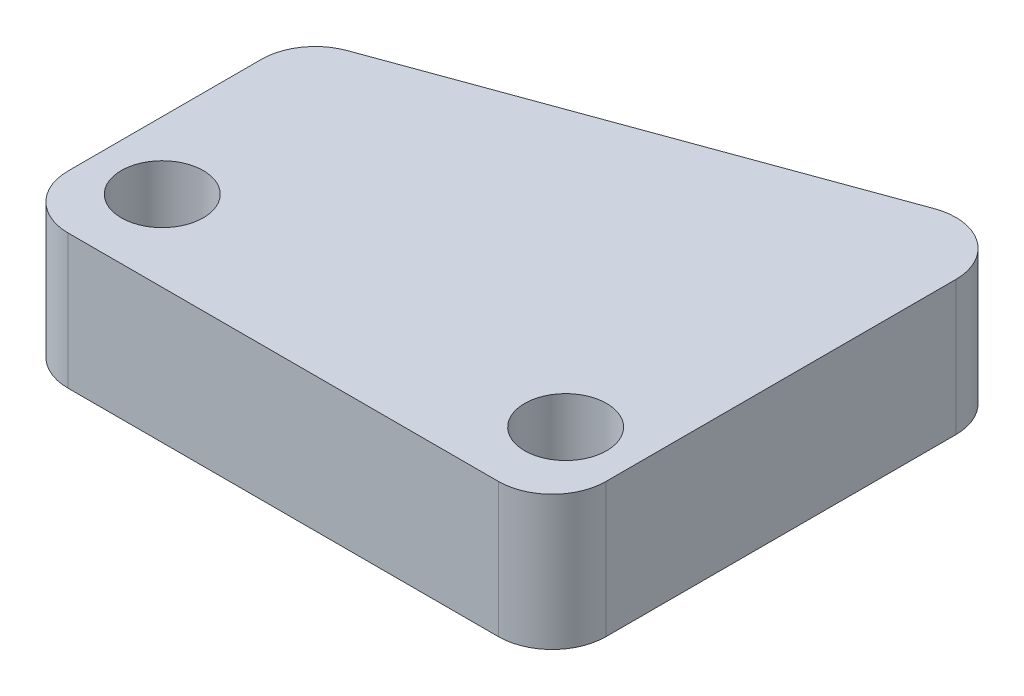
ISO-10303-21;
HEADER;
FILE_DESCRIPTION(('STEP AP214'),'2;1');
FILE_NAME('part.step','',(''),(''),'','','');
FILE_SCHEMA(('AUTOMOTIVE_DESIGN { 1 0 10303 214 1 1 1 1 }'));
ENDSEC;
DATA;
#1=APPLICATION_CONTEXT('core data for automotive mechanical design processes');
#2=APPLICATION_PROTOCOL_DEFINITION('international standard','automotive_design',2000,#1);
#3=PRODUCT_CONTEXT('',#1,'mechanical');
#4=PRODUCT('Part','Part','',(#3));
#5=PRODUCT_RELATED_PRODUCT_CATEGORY('part','',(#4));
#6=PRODUCT_DEFINITION_FORMATION('','',#4);
#7=PRODUCT_DEFINITION_CONTEXT('part definition',#1,'design');
#8=PRODUCT_DEFINITION('design','',#6,#7);
#9=PRODUCT_DEFINITION_SHAPE('','',#8);
#10=(LENGTH_UNIT() NAMED_UNIT(*) SI_UNIT(.MILLI.,.METRE.));
#11=(NAMED_UNIT(*) PLANE_ANGLE_UNIT() SI_UNIT($,.RADIAN.));
#12=(NAMED_UNIT(*) SI_UNIT($,.STERADIAN.) SOLID_ANGLE_UNIT());
#13=UNCERTAINTY_MEASURE_WITH_UNIT(LENGTH_MEASURE(1.E-05),#10,'distance_accuracy_value','');
#14=(GEOMETRIC_REPRESENTATION_CONTEXT(3) GLOBAL_UNCERTAINTY_ASSIGNED_CONTEXT((#13)) GLOBAL_UNIT_ASSIGNED_CONTEXT((#10,
#11,#12)) REPRESENTATION_CONTEXT('',''));
#15=CARTESIAN_POINT('',(0.,0.,0.));
#16=DIRECTION('',(0.,0.,1.));
#17=DIRECTION('',(1.,0.,0.));
#18=AXIS2_PLACEMENT_3D('',#15,#16,#17);
#19=CARTESIAN_POINT('',(10.,5.,10.));
#20=DIRECTION('',(-1.,0.,0.));
#21=DIRECTION('',(0.,0.,1.));
#22=AXIS2_PLACEMENT_3D('',#19,#20,#21);
#23=PLANE('',#22);
#24=DIRECTION('',(0.,0.,-1.));
#25=VECTOR('',#24,1.);
#26=CARTESIAN_POINT('',(10.,5.,10.));
#27=LINE('',#26,#25);
#28=CARTESIAN_POINT('',(10.,5.,8.));
#29=VERTEX_POINT('',#28);
#30=CARTESIAN_POINT('',(10.,5.,-5.00891989410654));
#31=VERTEX_POINT('',#30);
#32=EDGE_CURVE('E129',#29,#31,#27,.T.);
#33=ORIENTED_EDGE('',*,*,#32,.F.);
#34=DIRECTION('',(0.,-1.,0.));
#35=VECTOR('',#34,1.);
#36=CARTESIAN_POINT('',(10.,5.,8.));
#37=LINE('',#36,#35);
#38=CARTESIAN_POINT('',(10.,0.,8.));
#39=VERTEX_POINT('',#38);
#40=EDGE_CURVE('E161',#29,#39,#37,.T.);
#41=ORIENTED_EDGE('',*,*,#40,.T.);
#42=DIRECTION('',(0.,0.,-1.));
#43=VECTOR('',#42,1.);
#44=CARTESIAN_POINT('',(10.,0.,10.));
#45=LINE('',#44,#43);
#46=CARTESIAN_POINT('',(10.,0.,-5.00891989410654));
#47=VERTEX_POINT('',#46);
#48=EDGE_CURVE('E134',#39,#47,#45,.T.);
#49=ORIENTED_EDGE('',*,*,#48,.T.);
#50=DIRECTION('',(0.,1.,0.));
#51=VECTOR('',#50,1.);
#52=CARTESIAN_POINT('',(10.,5.,-5.00891989410654));
#53=LINE('',#52,#51);
#54=EDGE_CURVE('E158',#47,#31,#53,.T.);
#55=ORIENTED_EDGE('',*,*,#54,.T.);
#56=EDGE_LOOP('',(#33,#41,#49,#55));
#57=FACE_BOUND('',#56,.T.);
#58=ADVANCED_FACE('F36',(#57),#23,.F.);
#59=CARTESIAN_POINT('',(-10.,5.,10.));
#60=DIRECTION('',(1.,0.,0.));
#61=DIRECTION('',(0.,0.,-1.));
#62=AXIS2_PLACEMENT_3D('',#59,#60,#61);
#63=PLANE('',#62);
#64=DIRECTION('',(0.,0.,1.));
#65=VECTOR('',#64,1.);
#66=CARTESIAN_POINT('',(-10.,0.,10.));
#67=LINE('',#66,#65);
#68=CARTESIAN_POINT('',(-10.,0.,0.814603854152647));
#69=VERTEX_POINT('',#68);
#70=CARTESIAN_POINT('',(-10.,0.,8.));
#71=VERTEX_POINT('',#70);
#72=EDGE_CURVE('E130',#69,#71,#67,.T.);
#73=ORIENTED_EDGE('',*,*,#72,.T.);
#74=DIRECTION('',(0.,-1.,0.));
#75=VECTOR('',#74,1.);
#76=CARTESIAN_POINT('',(-10.,5.,8.));
#77=LINE('',#76,#75);
#78=CARTESIAN_POINT('',(-10.,5.,8.));
#79=VERTEX_POINT('',#78);
#80=EDGE_CURVE('E107',#71,#79,#77,.F.);
#81=ORIENTED_EDGE('',*,*,#80,.T.);
#82=DIRECTION('',(0.,0.,1.));
#83=VECTOR('',#82,1.);
#84=CARTESIAN_POINT('',(-10.,5.,10.));
#85=LINE('',#84,#83);
#86=CARTESIAN_POINT('',(-10.,5.,0.814603854152647));
#87=VERTEX_POINT('',#86);
#88=EDGE_CURVE('E132',#87,#79,#85,.T.);
#89=ORIENTED_EDGE('',*,*,#88,.F.);
#90=DIRECTION('',(0.,1.,0.));
#91=VECTOR('',#90,1.);
#92=CARTESIAN_POINT('',(-10.,5.,0.814603854152647));
#93=LINE('',#92,#91);
#94=EDGE_CURVE('E112',#87,#69,#93,.F.);
#95=ORIENTED_EDGE('',*,*,#94,.T.);
#96=EDGE_LOOP('',(#73,#81,#89,#95));
#97=FACE_BOUND('',#96,.T.);
#98=ADVANCED_FACE('F213',(#97),#63,.F.);
#99=CARTESIAN_POINT('',(-10.,5.,10.));
#100=DIRECTION('',(0.,0.,-1.));
#101=DIRECTION('',(-1.,0.,0.));
#102=AXIS2_PLACEMENT_3D('',#99,#100,#101);
#103=PLANE('',#102);
#104=DIRECTION('',(1.,0.,0.));
#105=VECTOR('',#104,1.);
#106=CARTESIAN_POINT('',(-10.,5.,10.));
#107=LINE('',#106,#105);
#108=CARTESIAN_POINT('',(-8.,5.,10.));
#109=VERTEX_POINT('',#108);
#110=CARTESIAN_POINT('',(8.,5.,10.));
#111=VERTEX_POINT('',#110);
#112=EDGE_CURVE('E122',#109,#111,#107,.T.);
#113=ORIENTED_EDGE('',*,*,#112,.F.);
#114=DIRECTION('',(0.,-1.,0.));
#115=VECTOR('',#114,1.);
#116=CARTESIAN_POINT('',(-8.,5.,10.));
#117=LINE('',#116,#115);
#118=CARTESIAN_POINT('',(-8.,0.,10.));
#119=VERTEX_POINT('',#118);
#120=EDGE_CURVE('E106',#109,#119,#117,.T.);
#121=ORIENTED_EDGE('',*,*,#120,.T.);
#122=DIRECTION('',(1.,0.,0.));
#123=VECTOR('',#122,1.);
#124=CARTESIAN_POINT('',(-10.,0.,10.));
#125=LINE('',#124,#123);
#126=CARTESIAN_POINT('',(8.,0.,10.));
#127=VERTEX_POINT('',#126);
#128=EDGE_CURVE('E119',#119,#127,#125,.T.);
#129=ORIENTED_EDGE('',*,*,#128,.T.);
#130=DIRECTION('',(0.,-1.,0.));
#131=VECTOR('',#130,1.);
#132=CARTESIAN_POINT('',(8.,5.,10.));
#133=LINE('',#132,#131);
#134=EDGE_CURVE('E124',#127,#111,#133,.F.);
#135=ORIENTED_EDGE('',*,*,#134,.T.);
#136=EDGE_LOOP('',(#113,#121,#129,#135));
#137=FACE_BOUND('',#136,.T.);
#138=ADVANCED_FACE('F118',(#137),#103,.F.);
#139=CARTESIAN_POINT('',(0.,5.,0.));
#140=DIRECTION('',(0.,-1.,0.));
#141=DIRECTION('',(0.,0.,-1.));
#142=AXIS2_PLACEMENT_3D('',#139,#140,#141);
#143=PLANE('',#142);
#144=CARTESIAN_POINT('',(-7.5,5.,7.));
#145=DIRECTION('',(0.,1.,0.));
#146=DIRECTION('',(0.,0.,1.));
#147=AXIS2_PLACEMENT_3D('',#144,#145,#146);
#148=CIRCLE('',#147,1.525);
#149=CARTESIAN_POINT('',(-7.5,5.,8.525));
#150=VERTEX_POINT('',#149);
#151=EDGE_CURVE('E142',#150,#150,#148,.T.);
#152=ORIENTED_EDGE('',*,*,#151,.F.);
#153=EDGE_LOOP('',(#152));
#154=FACE_BOUND('',#153,.T.);
#155=CARTESIAN_POINT('',(7.5,5.,7.));
#156=DIRECTION('',(0.,1.,0.));
#157=DIRECTION('',(0.,0.,1.));
#158=AXIS2_PLACEMENT_3D('',#155,#156,#157);
#159=CIRCLE('',#158,1.525);
#160=CARTESIAN_POINT('',(7.5,5.,8.525));
#161=VERTEX_POINT('',#160);
#162=EDGE_CURVE('E174',#161,#161,#159,.T.);
#163=ORIENTED_EDGE('',*,*,#162,.F.);
#164=EDGE_LOOP('',(#163));
#165=FACE_BOUND('',#164,.T.);
#166=ORIENTED_EDGE('',*,*,#88,.T.);
#167=CARTESIAN_POINT('',(-8.,5.,8.));
#168=DIRECTION('',(0.,-1.,0.));
#169=DIRECTION('',(0.,0.,-1.));
#170=AXIS2_PLACEMENT_3D('',#167,#168,#169);
#171=CIRCLE('',#170,2.);
#172=EDGE_CURVE('E156',#79,#109,#171,.F.);
#173=ORIENTED_EDGE('',*,*,#172,.T.);
#174=ORIENTED_EDGE('',*,*,#112,.T.);
#175=CARTESIAN_POINT('',(8.,5.,8.));
#176=DIRECTION('',(0.,-1.,0.));
#177=DIRECTION('',(0.,0.,-1.));
#178=AXIS2_PLACEMENT_3D('',#175,#176,#177);
#179=CIRCLE('',#178,2.);
#180=EDGE_CURVE('E154',#111,#29,#179,.F.);
#181=ORIENTED_EDGE('',*,*,#180,.T.);
#182=ORIENTED_EDGE('',*,*,#32,.T.);
#183=CARTESIAN_POINT('',(8.,5.,-5.00891989410654));
#184=DIRECTION('',(0.,-1.,0.));
#185=DIRECTION('',(0.,0.,-1.));
#186=AXIS2_PLACEMENT_3D('',#183,#184,#185);
#187=CIRCLE('',#186,2.);
#188=CARTESIAN_POINT('',(7.31595971334867,5.,-6.88830513567836));
#189=VERTEX_POINT('',#188);
#190=EDGE_CURVE('E51',#31,#189,#187,.F.);
#191=ORIENTED_EDGE('',*,*,#190,.T.);
#192=DIRECTION('',(0.939692620785909,0.,-0.342020143325666));
#193=VECTOR('',#192,1.);
#194=CARTESIAN_POINT('',(-1.3580538820493,5.,-3.73122237533316));
#195=LINE('',#194,#193);
#196=CARTESIAN_POINT('',(-8.68404028665133,5.,-1.06478138741917));
#197=VERTEX_POINT('',#196);
#198=EDGE_CURVE('E169',#197,#189,#195,.T.);
#199=ORIENTED_EDGE('',*,*,#198,.F.);
#200=CARTESIAN_POINT('',(-8.,5.,0.814603854152647));
#201=DIRECTION('',(0.,-1.,0.));
#202=DIRECTION('',(0.,0.,-1.));
#203=AXIS2_PLACEMENT_3D('',#200,#201,#202);
#204=CIRCLE('',#203,2.);
#205=EDGE_CURVE('E59',#197,#87,#204,.F.);
#206=ORIENTED_EDGE('',*,*,#205,.T.);
#207=EDGE_LOOP('',(#166,#173,#174,#181,#182,#191,#199,#206));
#208=FACE_BOUND('',#207,.T.);
#209=ADVANCED_FACE('F181',(#154,#165,#208),#143,.F.);
#210=CARTESIAN_POINT('',(0.,0.,0.));
#211=DIRECTION('',(0.,-1.,0.));
#212=DIRECTION('',(0.,0.,-1.));
#213=AXIS2_PLACEMENT_3D('',#210,#211,#212);
#214=PLANE('',#213);
#215=ORIENTED_EDGE('',*,*,#128,.F.);
#216=CARTESIAN_POINT('',(-8.,0.,8.));
#217=DIRECTION('',(0.,-1.,0.));
#218=DIRECTION('',(0.,0.,-1.));
#219=AXIS2_PLACEMENT_3D('',#216,#217,#218);
#220=CIRCLE('',#219,2.);
#221=EDGE_CURVE('E102',#119,#71,#220,.T.);
#222=ORIENTED_EDGE('',*,*,#221,.T.);
#223=ORIENTED_EDGE('',*,*,#72,.F.);
#224=CARTESIAN_POINT('',(-8.,0.,0.814603854152647));
#225=DIRECTION('',(0.,-1.,0.));
#226=DIRECTION('',(0.,0.,-1.));
#227=AXIS2_PLACEMENT_3D('',#224,#225,#226);
#228=CIRCLE('',#227,2.);
#229=CARTESIAN_POINT('',(-8.68404028665133,0.,-1.06478138741917));
#230=VERTEX_POINT('',#229);
#231=EDGE_CURVE('E147',#69,#230,#228,.T.);
#232=ORIENTED_EDGE('',*,*,#231,.T.);
#233=DIRECTION('',(0.939692620785909,0.,-0.342020143325666));
#234=VECTOR('',#233,1.);
#235=CARTESIAN_POINT('',(-1.3580538820493,0.,-3.73122237533316));
#236=LINE('',#235,#234);
#237=CARTESIAN_POINT('',(7.31595971334867,0.,-6.88830513567836));
#238=VERTEX_POINT('',#237);
#239=EDGE_CURVE('E168',#230,#238,#236,.T.);
#240=ORIENTED_EDGE('',*,*,#239,.T.);
#241=CARTESIAN_POINT('',(8.,0.,-5.00891989410654));
#242=DIRECTION('',(0.,-1.,0.));
#243=DIRECTION('',(0.,0.,-1.));
#244=AXIS2_PLACEMENT_3D('',#241,#242,#243);
#245=CIRCLE('',#244,2.);
#246=EDGE_CURVE('E123',#238,#47,#245,.T.);
#247=ORIENTED_EDGE('',*,*,#246,.T.);
#248=ORIENTED_EDGE('',*,*,#48,.F.);
#249=CARTESIAN_POINT('',(8.,0.,8.));
#250=DIRECTION('',(0.,-1.,0.));
#251=DIRECTION('',(0.,0.,-1.));
#252=AXIS2_PLACEMENT_3D('',#249,#250,#251);
#253=CIRCLE('',#252,2.);
#254=EDGE_CURVE('E113',#39,#127,#253,.T.);
#255=ORIENTED_EDGE('',*,*,#254,.T.);
#256=EDGE_LOOP('',(#215,#222,#223,#232,#240,#247,#248,#255));
#257=FACE_BOUND('',#256,.T.);
#258=CARTESIAN_POINT('',(-7.5,0.,7.));
#259=DIRECTION('',(0.,-1.,0.));
#260=DIRECTION('',(0.,0.,-1.));
#261=AXIS2_PLACEMENT_3D('',#258,#259,#260);
#262=CIRCLE('',#261,1.525);
#263=CARTESIAN_POINT('',(-7.5,0.,5.475));
#264=VERTEX_POINT('',#263);
#265=EDGE_CURVE('E141',#264,#264,#262,.T.);
#266=ORIENTED_EDGE('',*,*,#265,.F.);
#267=EDGE_LOOP('',(#266));
#268=FACE_BOUND('',#267,.T.);
#269=CARTESIAN_POINT('',(7.5,0.,7.));
#270=DIRECTION('',(0.,-1.,0.));
#271=DIRECTION('',(0.,0.,-1.));
#272=AXIS2_PLACEMENT_3D('',#269,#270,#271);
#273=CIRCLE('',#272,1.525);
#274=CARTESIAN_POINT('',(7.5,0.,5.475));
#275=VERTEX_POINT('',#274);
#276=EDGE_CURVE('E138',#275,#275,#273,.T.);
#277=ORIENTED_EDGE('',*,*,#276,.F.);
#278=EDGE_LOOP('',(#277));
#279=FACE_BOUND('',#278,.T.);
#280=ADVANCED_FACE('F126',(#257,#268,#279),#214,.T.);
#281=CARTESIAN_POINT('',(7.5,-5.,7.));
#282=DIRECTION('',(0.,1.,0.));
#283=DIRECTION('',(0.,0.,1.));
#284=AXIS2_PLACEMENT_3D('',#281,#282,#283);
#285=CYLINDRICAL_SURFACE('',#284,1.525);
#286=ORIENTED_EDGE('',*,*,#276,.T.);
#287=EDGE_LOOP('',(#286));
#288=FACE_BOUND('',#287,.T.);
#289=ORIENTED_EDGE('',*,*,#162,.T.);
#290=EDGE_LOOP('',(#289));
#291=FACE_BOUND('',#290,.T.);
#292=ADVANCED_FACE('F201',(#288,#291),#285,.F.);
#293=CARTESIAN_POINT('',(-7.5,-5.,7.));
#294=DIRECTION('',(0.,1.,0.));
#295=DIRECTION('',(0.,0.,1.));
#296=AXIS2_PLACEMENT_3D('',#293,#294,#295);
#297=CYLINDRICAL_SURFACE('',#296,1.525);
#298=ORIENTED_EDGE('',*,*,#265,.T.);
#299=EDGE_LOOP('',(#298));
#300=FACE_BOUND('',#299,.T.);
#301=ORIENTED_EDGE('',*,*,#151,.T.);
#302=EDGE_LOOP('',(#301));
#303=FACE_BOUND('',#302,.T.);
#304=ADVANCED_FACE('F194',(#300,#303),#297,.F.);
#305=CARTESIAN_POINT('',(-1.3580538820493,0.,-3.73122237533316));
#306=DIRECTION('',(0.342020143325666,0.,0.939692620785909));
#307=DIRECTION('',(0.939692620785909,0.,-0.342020143325666));
#308=AXIS2_PLACEMENT_3D('',#305,#306,#307);
#309=PLANE('',#308);
#310=ORIENTED_EDGE('',*,*,#239,.F.);
#311=DIRECTION('',(0.,1.,0.));
#312=VECTOR('',#311,1.);
#313=CARTESIAN_POINT('',(-8.68404028665133,0.,-1.06478138741917));
#314=LINE('',#313,#312);
#315=EDGE_CURVE('E11',#230,#197,#314,.T.);
#316=ORIENTED_EDGE('',*,*,#315,.T.);
#317=ORIENTED_EDGE('',*,*,#198,.T.);
#318=DIRECTION('',(0.,1.,0.));
#319=VECTOR('',#318,1.);
#320=CARTESIAN_POINT('',(7.31595971334867,0.,-6.88830513567836));
#321=LINE('',#320,#319);
#322=EDGE_CURVE('E44',#189,#238,#321,.F.);
#323=ORIENTED_EDGE('',*,*,#322,.T.);
#324=EDGE_LOOP('',(#310,#316,#317,#323));
#325=FACE_BOUND('',#324,.T.);
#326=ADVANCED_FACE('F167',(#325),#309,.F.);
#327=CARTESIAN_POINT('',(-8.,5.,8.));
#328=DIRECTION('',(0.,-1.,0.));
#329=DIRECTION('',(0.,0.,-1.));
#330=AXIS2_PLACEMENT_3D('',#327,#328,#329);
#331=CYLINDRICAL_SURFACE('',#330,2.);
#332=ORIENTED_EDGE('',*,*,#172,.F.);
#333=ORIENTED_EDGE('',*,*,#80,.F.);
#334=ORIENTED_EDGE('',*,*,#221,.F.);
#335=ORIENTED_EDGE('',*,*,#120,.F.);
#336=EDGE_LOOP('',(#332,#333,#334,#335));
#337=FACE_BOUND('',#336,.T.);
#338=ADVANCED_FACE('F105',(#337),#331,.T.);
#339=CARTESIAN_POINT('',(8.,5.,8.));
#340=DIRECTION('',(0.,-1.,0.));
#341=DIRECTION('',(0.,0.,-1.));
#342=AXIS2_PLACEMENT_3D('',#339,#340,#341);
#343=CYLINDRICAL_SURFACE('',#342,2.);
#344=ORIENTED_EDGE('',*,*,#180,.F.);
#345=ORIENTED_EDGE('',*,*,#134,.F.);
#346=ORIENTED_EDGE('',*,*,#254,.F.);
#347=ORIENTED_EDGE('',*,*,#40,.F.);
#348=EDGE_LOOP('',(#344,#345,#346,#347));
#349=FACE_BOUND('',#348,.T.);
#350=ADVANCED_FACE('F184',(#349),#343,.T.);
#351=CARTESIAN_POINT('',(-8.,0.,0.814603854152647));
#352=DIRECTION('',(0.,1.,0.));
#353=DIRECTION('',(0.,0.,1.));
#354=AXIS2_PLACEMENT_3D('',#351,#352,#353);
#355=CYLINDRICAL_SURFACE('',#354,2.);
#356=ORIENTED_EDGE('',*,*,#231,.F.);
#357=ORIENTED_EDGE('',*,*,#94,.F.);
#358=ORIENTED_EDGE('',*,*,#205,.F.);
#359=ORIENTED_EDGE('',*,*,#315,.F.);
#360=EDGE_LOOP('',(#356,#357,#358,#359));
#361=FACE_BOUND('',#360,.T.);
#362=ADVANCED_FACE('F225',(#361),#355,.T.);
#363=CARTESIAN_POINT('',(8.,5.,-5.00891989410654));
#364=DIRECTION('',(0.,1.,0.));
#365=DIRECTION('',(0.,0.,1.));
#366=AXIS2_PLACEMENT_3D('',#363,#364,#365);
#367=CYLINDRICAL_SURFACE('',#366,2.);
#368=ORIENTED_EDGE('',*,*,#246,.F.);
#369=ORIENTED_EDGE('',*,*,#322,.F.);
#370=ORIENTED_EDGE('',*,*,#190,.F.);
#371=ORIENTED_EDGE('',*,*,#54,.F.);
#372=EDGE_LOOP('',(#368,#369,#370,#371));
#373=FACE_BOUND('',#372,.T.);
#374=ADVANCED_FACE('F38',(#373),#367,.T.);
#375=CLOSED_SHELL('',(#58,#98,#138,#209,#280,#292,#304,#326,#338,#350,#362,#374));
#376=MANIFOLD_SOLID_BREP('B2',#375);
#377=ADVANCED_BREP_SHAPE_REPRESENTATION('',(#18,#376),#14);
#378=SHAPE_DEFINITION_REPRESENTATION(#9,#377);
ENDSEC;
END-ISO-10303-21;
